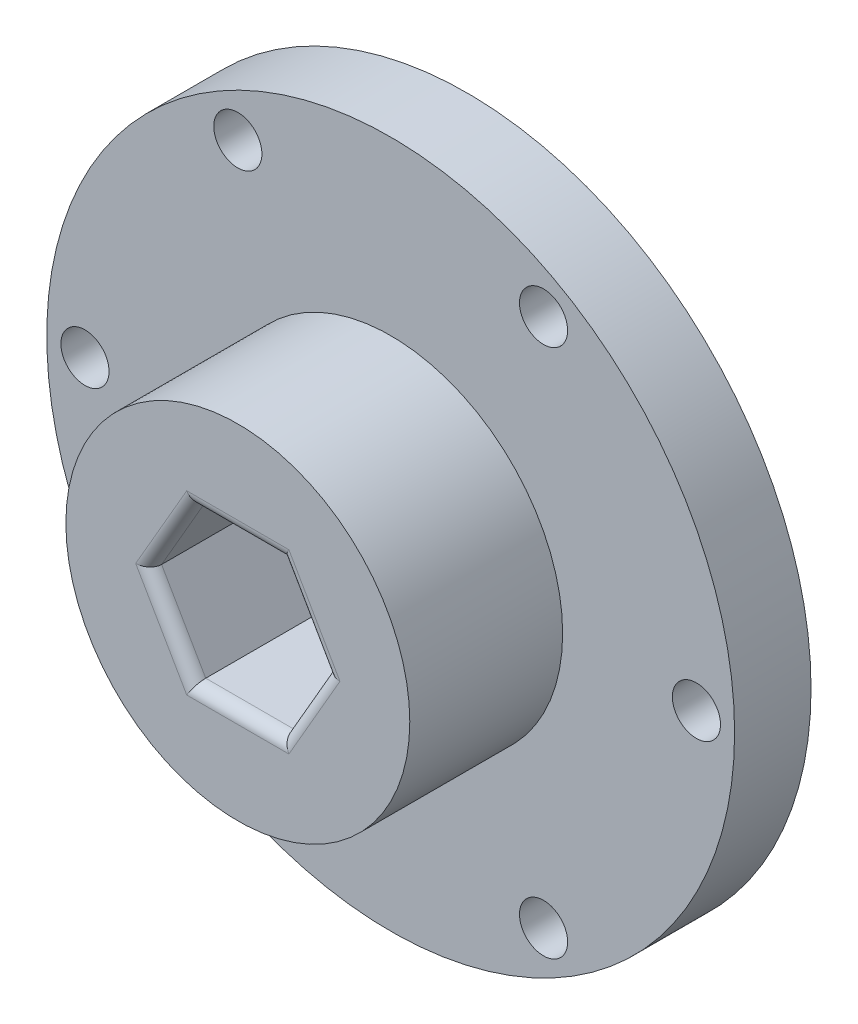
ISO-10303-21;
HEADER;
FILE_DESCRIPTION(('STEP AP214'),'2;1');
FILE_NAME('part.step','',(''),(''),'','','');
FILE_SCHEMA(('AUTOMOTIVE_DESIGN { 1 0 10303 214 1 1 1 1 }'));
ENDSEC;
DATA;
#1=APPLICATION_CONTEXT('core data for automotive mechanical design processes');
#2=APPLICATION_PROTOCOL_DEFINITION('international standard','automotive_design',2000,#1);
#3=PRODUCT_CONTEXT('',#1,'mechanical');
#4=PRODUCT('Part','Part','',(#3));
#5=PRODUCT_RELATED_PRODUCT_CATEGORY('part','',(#4));
#6=PRODUCT_DEFINITION_FORMATION('','',#4);
#7=PRODUCT_DEFINITION_CONTEXT('part definition',#1,'design');
#8=PRODUCT_DEFINITION('design','',#6,#7);
#9=PRODUCT_DEFINITION_SHAPE('','',#8);
#10=(LENGTH_UNIT() NAMED_UNIT(*) SI_UNIT(.MILLI.,.METRE.));
#11=(NAMED_UNIT(*) PLANE_ANGLE_UNIT() SI_UNIT($,.RADIAN.));
#12=(NAMED_UNIT(*) SI_UNIT($,.STERADIAN.) SOLID_ANGLE_UNIT());
#13=UNCERTAINTY_MEASURE_WITH_UNIT(LENGTH_MEASURE(1.E-05),#10,'distance_accuracy_value','');
#14=(GEOMETRIC_REPRESENTATION_CONTEXT(3) GLOBAL_UNCERTAINTY_ASSIGNED_CONTEXT((#13)) GLOBAL_UNIT_ASSIGNED_CONTEXT((#10,
#11,#12)) REPRESENTATION_CONTEXT('',''));
#15=CARTESIAN_POINT('',(0.,0.,0.));
#16=DIRECTION('',(0.,0.,1.));
#17=DIRECTION('',(1.,0.,0.));
#18=AXIS2_PLACEMENT_3D('',#15,#16,#17);
#19=CARTESIAN_POINT('',(0.,0.,6.35));
#20=DIRECTION('',(0.,0.,-1.));
#21=DIRECTION('',(-1.,0.,0.));
#22=AXIS2_PLACEMENT_3D('',#19,#20,#21);
#23=CYLINDRICAL_SURFACE('',#22,28.575);
#24=CARTESIAN_POINT('',(0.,0.,6.35));
#25=DIRECTION('',(0.,0.,1.));
#26=DIRECTION('',(1.,0.,0.));
#27=AXIS2_PLACEMENT_3D('',#24,#25,#26);
#28=CIRCLE('',#27,28.575);
#29=CARTESIAN_POINT('',(28.575,0.,6.35));
#30=VERTEX_POINT('',#29);
#31=EDGE_CURVE('E168',#30,#30,#28,.T.);
#32=ORIENTED_EDGE('',*,*,#31,.F.);
#33=EDGE_LOOP('',(#32));
#34=FACE_BOUND('',#33,.T.);
#35=CARTESIAN_POINT('',(0.,0.,0.));
#36=DIRECTION('',(0.,0.,1.));
#37=DIRECTION('',(1.,0.,0.));
#38=AXIS2_PLACEMENT_3D('',#35,#36,#37);
#39=CIRCLE('',#38,28.575);
#40=CARTESIAN_POINT('',(28.575,0.,0.));
#41=VERTEX_POINT('',#40);
#42=EDGE_CURVE('E163',#41,#41,#39,.T.);
#43=ORIENTED_EDGE('',*,*,#42,.T.);
#44=EDGE_LOOP('',(#43));
#45=FACE_BOUND('',#44,.T.);
#46=ADVANCED_FACE('F39',(#34,#45),#23,.T.);
#47=CARTESIAN_POINT('',(0.,0.,6.35));
#48=DIRECTION('',(0.,0.,1.));
#49=DIRECTION('',(1.,0.,0.));
#50=AXIS2_PLACEMENT_3D('',#47,#48,#49);
#51=PLANE('',#50);
#52=CARTESIAN_POINT('',(25.4,0.,6.35));
#53=DIRECTION('',(0.,0.,1.));
#54=DIRECTION('',(1.,0.,0.));
#55=AXIS2_PLACEMENT_3D('',#52,#53,#54);
#56=CIRCLE('',#55,2.);
#57=CARTESIAN_POINT('',(27.4,0.,6.35));
#58=VERTEX_POINT('',#57);
#59=EDGE_CURVE('E136',#58,#58,#56,.T.);
#60=ORIENTED_EDGE('',*,*,#59,.F.);
#61=EDGE_LOOP('',(#60));
#62=FACE_BOUND('',#61,.T.);
#63=CARTESIAN_POINT('',(12.7000000000003,21.9970452561246,6.35));
#64=DIRECTION('',(0.,0.,1.));
#65=DIRECTION('',(1.,0.,0.));
#66=AXIS2_PLACEMENT_3D('',#63,#64,#65);
#67=CIRCLE('',#66,2.);
#68=CARTESIAN_POINT('',(14.7000000000003,21.9970452561246,6.35));
#69=VERTEX_POINT('',#68);
#70=EDGE_CURVE('E215',#69,#69,#67,.T.);
#71=ORIENTED_EDGE('',*,*,#70,.F.);
#72=EDGE_LOOP('',(#71));
#73=FACE_BOUND('',#72,.T.);
#74=CARTESIAN_POINT('',(-12.6999999999998,21.9970452561249,6.35));
#75=DIRECTION('',(0.,0.,1.));
#76=DIRECTION('',(1.,0.,0.));
#77=AXIS2_PLACEMENT_3D('',#74,#75,#76);
#78=CIRCLE('',#77,2.);
#79=CARTESIAN_POINT('',(-10.6999999999998,21.9970452561249,6.35));
#80=VERTEX_POINT('',#79);
#81=EDGE_CURVE('E240',#80,#80,#78,.T.);
#82=ORIENTED_EDGE('',*,*,#81,.F.);
#83=EDGE_LOOP('',(#82));
#84=FACE_BOUND('',#83,.T.);
#85=CARTESIAN_POINT('',(-25.4,1.77367252013231E-13,6.35));
#86=DIRECTION('',(0.,0.,1.));
#87=DIRECTION('',(1.,0.,0.));
#88=AXIS2_PLACEMENT_3D('',#85,#86,#87);
#89=CIRCLE('',#88,2.);
#90=CARTESIAN_POINT('',(-23.4,1.77367252013231E-13,6.35));
#91=VERTEX_POINT('',#90);
#92=EDGE_CURVE('E235',#91,#91,#89,.T.);
#93=ORIENTED_EDGE('',*,*,#92,.F.);
#94=EDGE_LOOP('',(#93));
#95=FACE_BOUND('',#94,.T.);
#96=CARTESIAN_POINT('',(-12.7000000000001,-21.9970452561247,6.35));
#97=DIRECTION('',(0.,0.,1.));
#98=DIRECTION('',(1.,0.,0.));
#99=AXIS2_PLACEMENT_3D('',#96,#97,#98);
#100=CIRCLE('',#99,2.00000000000001);
#101=CARTESIAN_POINT('',(-10.7000000000001,-21.9970452561247,6.35));
#102=VERTEX_POINT('',#101);
#103=EDGE_CURVE('E229',#102,#102,#100,.T.);
#104=ORIENTED_EDGE('',*,*,#103,.F.);
#105=EDGE_LOOP('',(#104));
#106=FACE_BOUND('',#105,.T.);
#107=CARTESIAN_POINT('',(12.6999999999999,-21.9970452561248,6.35));
#108=DIRECTION('',(0.,0.,1.));
#109=DIRECTION('',(1.,0.,0.));
#110=AXIS2_PLACEMENT_3D('',#107,#108,#109);
#111=CIRCLE('',#110,2.);
#112=CARTESIAN_POINT('',(14.7,-21.9970452561248,6.35));
#113=VERTEX_POINT('',#112);
#114=EDGE_CURVE('E223',#113,#113,#111,.T.);
#115=ORIENTED_EDGE('',*,*,#114,.F.);
#116=EDGE_LOOP('',(#115));
#117=FACE_BOUND('',#116,.T.);
#118=CARTESIAN_POINT('',(0.,0.,6.35));
#119=DIRECTION('',(0.,0.,1.));
#120=DIRECTION('',(1.,0.,0.));
#121=AXIS2_PLACEMENT_3D('',#118,#119,#120);
#122=CIRCLE('',#121,14.2875);
#123=CARTESIAN_POINT('',(14.2875,0.,6.35));
#124=VERTEX_POINT('',#123);
#125=EDGE_CURVE('E164',#124,#124,#122,.T.);
#126=ORIENTED_EDGE('',*,*,#125,.F.);
#127=EDGE_LOOP('',(#126));
#128=FACE_BOUND('',#127,.T.);
#129=ORIENTED_EDGE('',*,*,#31,.T.);
#130=EDGE_LOOP('',(#129));
#131=FACE_BOUND('',#130,.T.);
#132=ADVANCED_FACE('F266',(#62,#73,#84,#95,#106,#117,#128,#131),#51,.T.);
#133=CARTESIAN_POINT('',(0.,0.,0.));
#134=DIRECTION('',(0.,0.,1.));
#135=DIRECTION('',(1.,0.,0.));
#136=AXIS2_PLACEMENT_3D('',#133,#134,#135);
#137=PLANE('',#136);
#138=CARTESIAN_POINT('',(25.4,0.,0.));
#139=DIRECTION('',(0.,0.,1.));
#140=DIRECTION('',(1.,0.,0.));
#141=AXIS2_PLACEMENT_3D('',#138,#139,#140);
#142=CIRCLE('',#141,2.);
#143=CARTESIAN_POINT('',(27.4,0.,0.));
#144=VERTEX_POINT('',#143);
#145=EDGE_CURVE('E133',#144,#144,#142,.T.);
#146=ORIENTED_EDGE('',*,*,#145,.T.);
#147=EDGE_LOOP('',(#146));
#148=FACE_BOUND('',#147,.T.);
#149=CARTESIAN_POINT('',(12.7000000000003,21.9970452561246,0.));
#150=DIRECTION('',(0.,0.,1.));
#151=DIRECTION('',(1.,0.,0.));
#152=AXIS2_PLACEMENT_3D('',#149,#150,#151);
#153=CIRCLE('',#152,2.);
#154=CARTESIAN_POINT('',(14.7000000000003,21.9970452561246,0.));
#155=VERTEX_POINT('',#154);
#156=EDGE_CURVE('E210',#155,#155,#153,.T.);
#157=ORIENTED_EDGE('',*,*,#156,.T.);
#158=EDGE_LOOP('',(#157));
#159=FACE_BOUND('',#158,.T.);
#160=CARTESIAN_POINT('',(-12.6999999999998,21.9970452561249,0.));
#161=DIRECTION('',(0.,0.,1.));
#162=DIRECTION('',(1.,0.,0.));
#163=AXIS2_PLACEMENT_3D('',#160,#161,#162);
#164=CIRCLE('',#163,2.);
#165=CARTESIAN_POINT('',(-10.6999999999998,21.9970452561249,0.));
#166=VERTEX_POINT('',#165);
#167=EDGE_CURVE('E139',#166,#166,#164,.T.);
#168=ORIENTED_EDGE('',*,*,#167,.T.);
#169=EDGE_LOOP('',(#168));
#170=FACE_BOUND('',#169,.T.);
#171=CARTESIAN_POINT('',(-25.4,1.77367252013231E-13,0.));
#172=DIRECTION('',(0.,0.,1.));
#173=DIRECTION('',(1.,0.,0.));
#174=AXIS2_PLACEMENT_3D('',#171,#172,#173);
#175=CIRCLE('',#174,2.);
#176=CARTESIAN_POINT('',(-23.4,1.77367252013231E-13,0.));
#177=VERTEX_POINT('',#176);
#178=EDGE_CURVE('E238',#177,#177,#175,.T.);
#179=ORIENTED_EDGE('',*,*,#178,.T.);
#180=EDGE_LOOP('',(#179));
#181=FACE_BOUND('',#180,.T.);
#182=CARTESIAN_POINT('',(-12.7000000000001,-21.9970452561247,0.));
#183=DIRECTION('',(0.,0.,1.));
#184=DIRECTION('',(1.,0.,0.));
#185=AXIS2_PLACEMENT_3D('',#182,#183,#184);
#186=CIRCLE('',#185,2.00000000000001);
#187=CARTESIAN_POINT('',(-10.7000000000001,-21.9970452561247,0.));
#188=VERTEX_POINT('',#187);
#189=EDGE_CURVE('E232',#188,#188,#186,.T.);
#190=ORIENTED_EDGE('',*,*,#189,.T.);
#191=EDGE_LOOP('',(#190));
#192=FACE_BOUND('',#191,.T.);
#193=CARTESIAN_POINT('',(12.6999999999999,-21.9970452561248,0.));
#194=DIRECTION('',(0.,0.,1.));
#195=DIRECTION('',(1.,0.,0.));
#196=AXIS2_PLACEMENT_3D('',#193,#194,#195);
#197=CIRCLE('',#196,2.);
#198=CARTESIAN_POINT('',(14.7,-21.9970452561248,0.));
#199=VERTEX_POINT('',#198);
#200=EDGE_CURVE('E226',#199,#199,#197,.T.);
#201=ORIENTED_EDGE('',*,*,#200,.T.);
#202=EDGE_LOOP('',(#201));
#203=FACE_BOUND('',#202,.T.);
#204=DIRECTION('',(1.,0.,0.));
#205=VECTOR('',#204,1.);
#206=CARTESIAN_POINT('',(-3.66617420935413,-6.35,0.));
#207=LINE('',#206,#205);
#208=CARTESIAN_POINT('',(-3.66617420935413,-6.35,0.));
#209=VERTEX_POINT('',#208);
#210=CARTESIAN_POINT('',(3.66617420935412,-6.35,0.));
#211=VERTEX_POINT('',#210);
#212=EDGE_CURVE('E118',#209,#211,#207,.T.);
#213=ORIENTED_EDGE('',*,*,#212,.T.);
#214=DIRECTION('',(0.5,0.866025403784439,0.));
#215=VECTOR('',#214,1.);
#216=CARTESIAN_POINT('',(3.66617420935412,-6.35,0.));
#217=LINE('',#216,#215);
#218=CARTESIAN_POINT('',(7.33234841870824,0.,0.));
#219=VERTEX_POINT('',#218);
#220=EDGE_CURVE('E113',#211,#219,#217,.T.);
#221=ORIENTED_EDGE('',*,*,#220,.T.);
#222=DIRECTION('',(-0.5,0.866025403784439,0.));
#223=VECTOR('',#222,1.);
#224=CARTESIAN_POINT('',(7.33234841870824,0.,0.));
#225=LINE('',#224,#223);
#226=CARTESIAN_POINT('',(3.66617420935412,6.35,0.));
#227=VERTEX_POINT('',#226);
#228=EDGE_CURVE('E122',#219,#227,#225,.T.);
#229=ORIENTED_EDGE('',*,*,#228,.T.);
#230=DIRECTION('',(-1.,0.,0.));
#231=VECTOR('',#230,1.);
#232=CARTESIAN_POINT('',(3.66617420935412,6.35,0.));
#233=LINE('',#232,#231);
#234=CARTESIAN_POINT('',(-3.66617420935412,6.35,0.));
#235=VERTEX_POINT('',#234);
#236=EDGE_CURVE('E127',#227,#235,#233,.T.);
#237=ORIENTED_EDGE('',*,*,#236,.T.);
#238=DIRECTION('',(-0.5,-0.866025403784439,0.));
#239=VECTOR('',#238,1.);
#240=CARTESIAN_POINT('',(-3.66617420935412,6.35,0.));
#241=LINE('',#240,#239);
#242=CARTESIAN_POINT('',(-7.33234841870825,0.,0.));
#243=VERTEX_POINT('',#242);
#244=EDGE_CURVE('E143',#235,#243,#241,.T.);
#245=ORIENTED_EDGE('',*,*,#244,.T.);
#246=DIRECTION('',(0.5,-0.866025403784439,0.));
#247=VECTOR('',#246,1.);
#248=CARTESIAN_POINT('',(-7.33234841870825,0.,0.));
#249=LINE('',#248,#247);
#250=EDGE_CURVE('E146',#243,#209,#249,.T.);
#251=ORIENTED_EDGE('',*,*,#250,.T.);
#252=EDGE_LOOP('',(#213,#221,#229,#237,#245,#251));
#253=FACE_BOUND('',#252,.T.);
#254=ORIENTED_EDGE('',*,*,#42,.F.);
#255=EDGE_LOOP('',(#254));
#256=FACE_BOUND('',#255,.T.);
#257=ADVANCED_FACE('F129',(#148,#159,#170,#181,#192,#203,#253,#256),#137,.F.);
#258=CARTESIAN_POINT('',(0.,0.,19.05));
#259=DIRECTION('',(0.,0.,-1.));
#260=DIRECTION('',(-1.,0.,0.));
#261=AXIS2_PLACEMENT_3D('',#258,#259,#260);
#262=CYLINDRICAL_SURFACE('',#261,14.2875);
#263=CARTESIAN_POINT('',(0.,0.,19.05));
#264=DIRECTION('',(0.,0.,1.));
#265=DIRECTION('',(1.,0.,0.));
#266=AXIS2_PLACEMENT_3D('',#263,#264,#265);
#267=CIRCLE('',#266,14.2875);
#268=CARTESIAN_POINT('',(14.2875,0.,19.05));
#269=VERTEX_POINT('',#268);
#270=EDGE_CURVE('E151',#269,#269,#267,.T.);
#271=ORIENTED_EDGE('',*,*,#270,.F.);
#272=EDGE_LOOP('',(#271));
#273=FACE_BOUND('',#272,.T.);
#274=ORIENTED_EDGE('',*,*,#125,.T.);
#275=EDGE_LOOP('',(#274));
#276=FACE_BOUND('',#275,.T.);
#277=ADVANCED_FACE('F342',(#273,#276),#262,.T.);
#278=CARTESIAN_POINT('',(0.,0.,19.05));
#279=DIRECTION('',(0.,0.,1.));
#280=DIRECTION('',(1.,0.,0.));
#281=AXIS2_PLACEMENT_3D('',#278,#279,#280);
#282=PLANE('',#281);
#283=DIRECTION('',(-0.5,-0.866025403784439,0.));
#284=VECTOR('',#283,1.);
#285=CARTESIAN_POINT('',(-4.53219961313856,6.85,19.05));
#286=LINE('',#285,#284);
#287=CARTESIAN_POINT('',(-8.4870489570875,0.,19.05));
#288=VERTEX_POINT('',#287);
#289=CARTESIAN_POINT('',(-4.24352447854375,7.35,19.05));
#290=VERTEX_POINT('',#289);
#291=EDGE_CURVE('E183',#288,#290,#286,.F.);
#292=ORIENTED_EDGE('',*,*,#291,.T.);
#293=DIRECTION('',(-1.,0.,0.));
#294=VECTOR('',#293,1.);
#295=CARTESIAN_POINT('',(3.66617420935412,7.35,19.05));
#296=LINE('',#295,#294);
#297=CARTESIAN_POINT('',(4.24352447854375,7.35,19.05));
#298=VERTEX_POINT('',#297);
#299=EDGE_CURVE('E185',#290,#298,#296,.F.);
#300=ORIENTED_EDGE('',*,*,#299,.T.);
#301=DIRECTION('',(-0.5,0.866025403784439,0.));
#302=VECTOR('',#301,1.);
#303=CARTESIAN_POINT('',(8.19837382249268,0.5,19.05));
#304=LINE('',#303,#302);
#305=CARTESIAN_POINT('',(8.4870489570875,0.,19.05));
#306=VERTEX_POINT('',#305);
#307=EDGE_CURVE('E175',#298,#306,#304,.F.);
#308=ORIENTED_EDGE('',*,*,#307,.T.);
#309=DIRECTION('',(0.5,0.866025403784439,0.));
#310=VECTOR('',#309,1.);
#311=CARTESIAN_POINT('',(4.53219961313856,-6.85,19.05));
#312=LINE('',#311,#310);
#313=CARTESIAN_POINT('',(4.24352447854375,-7.35,19.05));
#314=VERTEX_POINT('',#313);
#315=EDGE_CURVE('E177',#306,#314,#312,.F.);
#316=ORIENTED_EDGE('',*,*,#315,.T.);
#317=DIRECTION('',(1.,0.,0.));
#318=VECTOR('',#317,1.);
#319=CARTESIAN_POINT('',(-3.66617420935413,-7.35,19.05));
#320=LINE('',#319,#318);
#321=CARTESIAN_POINT('',(-4.24352447854375,-7.35,19.05));
#322=VERTEX_POINT('',#321);
#323=EDGE_CURVE('E179',#314,#322,#320,.F.);
#324=ORIENTED_EDGE('',*,*,#323,.T.);
#325=DIRECTION('',(0.5,-0.866025403784439,0.));
#326=VECTOR('',#325,1.);
#327=CARTESIAN_POINT('',(-8.19837382249269,-0.499999999999999,19.05));
#328=LINE('',#327,#326);
#329=EDGE_CURVE('E181',#322,#288,#328,.F.);
#330=ORIENTED_EDGE('',*,*,#329,.T.);
#331=EDGE_LOOP('',(#292,#300,#308,#316,#324,#330));
#332=FACE_BOUND('',#331,.T.);
#333=ORIENTED_EDGE('',*,*,#270,.T.);
#334=EDGE_LOOP('',(#333));
#335=FACE_BOUND('',#334,.T.);
#336=ADVANCED_FACE('F309',(#332,#335),#282,.T.);
#337=CARTESIAN_POINT('',(3.66617420935412,-6.35,0.));
#338=DIRECTION('',(0.866025403784439,-0.5,0.));
#339=DIRECTION('',(0.5,0.866025403784439,0.));
#340=AXIS2_PLACEMENT_3D('',#337,#338,#339);
#341=PLANE('',#340);
#342=DIRECTION('',(0.,0.,1.));
#343=VECTOR('',#342,1.);
#344=CARTESIAN_POINT('',(3.66617420935412,-6.35,0.));
#345=LINE('',#344,#343);
#346=CARTESIAN_POINT('',(3.66617420935412,-6.35,18.05));
#347=VERTEX_POINT('',#346);
#348=EDGE_CURVE('E149',#211,#347,#345,.T.);
#349=ORIENTED_EDGE('',*,*,#348,.T.);
#350=DIRECTION('',(0.5,0.866025403784439,0.));
#351=VECTOR('',#350,1.);
#352=CARTESIAN_POINT('',(7.33234841870824,0.,18.05));
#353=LINE('',#352,#351);
#354=CARTESIAN_POINT('',(7.33234841870824,0.,18.05));
#355=VERTEX_POINT('',#354);
#356=EDGE_CURVE('E48',#347,#355,#353,.T.);
#357=ORIENTED_EDGE('',*,*,#356,.T.);
#358=DIRECTION('',(0.,0.,1.));
#359=VECTOR('',#358,1.);
#360=CARTESIAN_POINT('',(7.33234841870824,0.,0.));
#361=LINE('',#360,#359);
#362=EDGE_CURVE('E109',#219,#355,#361,.T.);
#363=ORIENTED_EDGE('',*,*,#362,.F.);
#364=ORIENTED_EDGE('',*,*,#220,.F.);
#365=EDGE_LOOP('',(#349,#357,#363,#364));
#366=FACE_BOUND('',#365,.T.);
#367=ADVANCED_FACE('F111',(#366),#341,.F.);
#368=CARTESIAN_POINT('',(-3.66617420935413,-6.35,0.));
#369=DIRECTION('',(0.,-1.,0.));
#370=DIRECTION('',(1.,0.,0.));
#371=AXIS2_PLACEMENT_3D('',#368,#369,#370);
#372=PLANE('',#371);
#373=DIRECTION('',(0.,0.,1.));
#374=VECTOR('',#373,1.);
#375=CARTESIAN_POINT('',(-3.66617420935413,-6.35,0.));
#376=LINE('',#375,#374);
#377=CARTESIAN_POINT('',(-3.66617420935413,-6.35,18.05));
#378=VERTEX_POINT('',#377);
#379=EDGE_CURVE('E152',#209,#378,#376,.T.);
#380=ORIENTED_EDGE('',*,*,#379,.T.);
#381=DIRECTION('',(1.,0.,0.));
#382=VECTOR('',#381,1.);
#383=CARTESIAN_POINT('',(3.66617420935412,-6.35,18.05));
#384=LINE('',#383,#382);
#385=EDGE_CURVE('E63',#378,#347,#384,.T.);
#386=ORIENTED_EDGE('',*,*,#385,.T.);
#387=ORIENTED_EDGE('',*,*,#348,.F.);
#388=ORIENTED_EDGE('',*,*,#212,.F.);
#389=EDGE_LOOP('',(#380,#386,#387,#388));
#390=FACE_BOUND('',#389,.T.);
#391=ADVANCED_FACE('F325',(#390),#372,.F.);
#392=CARTESIAN_POINT('',(-7.33234841870825,0.,0.));
#393=DIRECTION('',(-0.866025403784439,-0.5,0.));
#394=DIRECTION('',(0.5,-0.866025403784439,0.));
#395=AXIS2_PLACEMENT_3D('',#392,#393,#394);
#396=PLANE('',#395);
#397=DIRECTION('',(0.,0.,1.));
#398=VECTOR('',#397,1.);
#399=CARTESIAN_POINT('',(-7.33234841870825,0.,0.));
#400=LINE('',#399,#398);
#401=CARTESIAN_POINT('',(-7.33234841870825,0.,18.05));
#402=VERTEX_POINT('',#401);
#403=EDGE_CURVE('E154',#243,#402,#400,.T.);
#404=ORIENTED_EDGE('',*,*,#403,.T.);
#405=DIRECTION('',(0.5,-0.866025403784439,0.));
#406=VECTOR('',#405,1.);
#407=CARTESIAN_POINT('',(-3.66617420935413,-6.35,18.05));
#408=LINE('',#407,#406);
#409=EDGE_CURVE('E190',#402,#378,#408,.T.);
#410=ORIENTED_EDGE('',*,*,#409,.T.);
#411=ORIENTED_EDGE('',*,*,#379,.F.);
#412=ORIENTED_EDGE('',*,*,#250,.F.);
#413=EDGE_LOOP('',(#404,#410,#411,#412));
#414=FACE_BOUND('',#413,.T.);
#415=ADVANCED_FACE('F324',(#414),#396,.F.);
#416=CARTESIAN_POINT('',(-3.66617420935412,6.35,0.));
#417=DIRECTION('',(-0.866025403784439,0.5,0.));
#418=DIRECTION('',(-0.5,-0.866025403784439,0.));
#419=AXIS2_PLACEMENT_3D('',#416,#417,#418);
#420=PLANE('',#419);
#421=DIRECTION('',(0.,0.,1.));
#422=VECTOR('',#421,1.);
#423=CARTESIAN_POINT('',(-3.66617420935412,6.35,0.));
#424=LINE('',#423,#422);
#425=CARTESIAN_POINT('',(-3.66617420935412,6.35,18.05));
#426=VERTEX_POINT('',#425);
#427=EDGE_CURVE('E157',#235,#426,#424,.T.);
#428=ORIENTED_EDGE('',*,*,#427,.T.);
#429=DIRECTION('',(-0.5,-0.866025403784439,0.));
#430=VECTOR('',#429,1.);
#431=CARTESIAN_POINT('',(-7.33234841870825,0.,18.05));
#432=LINE('',#431,#430);
#433=EDGE_CURVE('E188',#426,#402,#432,.T.);
#434=ORIENTED_EDGE('',*,*,#433,.T.);
#435=ORIENTED_EDGE('',*,*,#403,.F.);
#436=ORIENTED_EDGE('',*,*,#244,.F.);
#437=EDGE_LOOP('',(#428,#434,#435,#436));
#438=FACE_BOUND('',#437,.T.);
#439=ADVANCED_FACE('F321',(#438),#420,.F.);
#440=CARTESIAN_POINT('',(3.66617420935412,6.35,0.));
#441=DIRECTION('',(0.,1.,0.));
#442=DIRECTION('',(-1.,0.,0.));
#443=AXIS2_PLACEMENT_3D('',#440,#441,#442);
#444=PLANE('',#443);
#445=DIRECTION('',(0.,0.,1.));
#446=VECTOR('',#445,1.);
#447=CARTESIAN_POINT('',(3.66617420935412,6.35,0.));
#448=LINE('',#447,#446);
#449=CARTESIAN_POINT('',(3.66617420935412,6.35,18.05));
#450=VERTEX_POINT('',#449);
#451=EDGE_CURVE('E117',#227,#450,#448,.T.);
#452=ORIENTED_EDGE('',*,*,#451,.T.);
#453=DIRECTION('',(-1.,0.,0.));
#454=VECTOR('',#453,1.);
#455=CARTESIAN_POINT('',(-3.66617420935412,6.35,18.05));
#456=LINE('',#455,#454);
#457=EDGE_CURVE('E167',#450,#426,#456,.T.);
#458=ORIENTED_EDGE('',*,*,#457,.T.);
#459=ORIENTED_EDGE('',*,*,#427,.F.);
#460=ORIENTED_EDGE('',*,*,#236,.F.);
#461=EDGE_LOOP('',(#452,#458,#459,#460));
#462=FACE_BOUND('',#461,.T.);
#463=ADVANCED_FACE('F317',(#462),#444,.F.);
#464=CARTESIAN_POINT('',(7.33234841870824,0.,0.));
#465=DIRECTION('',(0.866025403784439,0.5,0.));
#466=DIRECTION('',(-0.5,0.866025403784439,0.));
#467=AXIS2_PLACEMENT_3D('',#464,#465,#466);
#468=PLANE('',#467);
#469=ORIENTED_EDGE('',*,*,#362,.T.);
#470=DIRECTION('',(-0.5,0.866025403784439,0.));
#471=VECTOR('',#470,1.);
#472=CARTESIAN_POINT('',(3.66617420935412,6.35,18.05));
#473=LINE('',#472,#471);
#474=EDGE_CURVE('E11',#355,#450,#473,.T.);
#475=ORIENTED_EDGE('',*,*,#474,.T.);
#476=ORIENTED_EDGE('',*,*,#451,.F.);
#477=ORIENTED_EDGE('',*,*,#228,.F.);
#478=EDGE_LOOP('',(#469,#475,#476,#477));
#479=FACE_BOUND('',#478,.T.);
#480=ADVANCED_FACE('F123',(#479),#468,.F.);
#481=CARTESIAN_POINT('',(12.6999999999999,-21.9970452561248,0.));
#482=DIRECTION('',(0.,0.,1.));
#483=DIRECTION('',(1.,0.,0.));
#484=AXIS2_PLACEMENT_3D('',#481,#482,#483);
#485=CYLINDRICAL_SURFACE('',#484,2.);
#486=ORIENTED_EDGE('',*,*,#200,.F.);
#487=EDGE_LOOP('',(#486));
#488=FACE_BOUND('',#487,.T.);
#489=ORIENTED_EDGE('',*,*,#114,.T.);
#490=EDGE_LOOP('',(#489));
#491=FACE_BOUND('',#490,.T.);
#492=ADVANCED_FACE('F338',(#488,#491),#485,.F.);
#493=CARTESIAN_POINT('',(-12.7000000000001,-21.9970452561247,0.));
#494=DIRECTION('',(0.,0.,1.));
#495=DIRECTION('',(1.,0.,0.));
#496=AXIS2_PLACEMENT_3D('',#493,#494,#495);
#497=CYLINDRICAL_SURFACE('',#496,2.00000000000001);
#498=ORIENTED_EDGE('',*,*,#189,.F.);
#499=EDGE_LOOP('',(#498));
#500=FACE_BOUND('',#499,.T.);
#501=ORIENTED_EDGE('',*,*,#103,.T.);
#502=EDGE_LOOP('',(#501));
#503=FACE_BOUND('',#502,.T.);
#504=ADVANCED_FACE('F261',(#500,#503),#497,.F.);
#505=CARTESIAN_POINT('',(-25.4,1.77367252013231E-13,0.));
#506=DIRECTION('',(0.,0.,1.));
#507=DIRECTION('',(1.,0.,0.));
#508=AXIS2_PLACEMENT_3D('',#505,#506,#507);
#509=CYLINDRICAL_SURFACE('',#508,2.);
#510=ORIENTED_EDGE('',*,*,#178,.F.);
#511=EDGE_LOOP('',(#510));
#512=FACE_BOUND('',#511,.T.);
#513=ORIENTED_EDGE('',*,*,#92,.T.);
#514=EDGE_LOOP('',(#513));
#515=FACE_BOUND('',#514,.T.);
#516=ADVANCED_FACE('F252',(#512,#515),#509,.F.);
#517=CARTESIAN_POINT('',(-12.6999999999998,21.9970452561249,0.));
#518=DIRECTION('',(0.,0.,1.));
#519=DIRECTION('',(1.,0.,0.));
#520=AXIS2_PLACEMENT_3D('',#517,#518,#519);
#521=CYLINDRICAL_SURFACE('',#520,2.);
#522=ORIENTED_EDGE('',*,*,#167,.F.);
#523=EDGE_LOOP('',(#522));
#524=FACE_BOUND('',#523,.T.);
#525=ORIENTED_EDGE('',*,*,#81,.T.);
#526=EDGE_LOOP('',(#525));
#527=FACE_BOUND('',#526,.T.);
#528=ADVANCED_FACE('F249',(#524,#527),#521,.F.);
#529=CARTESIAN_POINT('',(12.7000000000003,21.9970452561246,0.));
#530=DIRECTION('',(0.,0.,1.));
#531=DIRECTION('',(1.,0.,0.));
#532=AXIS2_PLACEMENT_3D('',#529,#530,#531);
#533=CYLINDRICAL_SURFACE('',#532,2.);
#534=ORIENTED_EDGE('',*,*,#156,.F.);
#535=EDGE_LOOP('',(#534));
#536=FACE_BOUND('',#535,.T.);
#537=ORIENTED_EDGE('',*,*,#70,.T.);
#538=EDGE_LOOP('',(#537));
#539=FACE_BOUND('',#538,.T.);
#540=ADVANCED_FACE('F251',(#536,#539),#533,.F.);
#541=CARTESIAN_POINT('',(25.4,0.,0.));
#542=DIRECTION('',(0.,0.,1.));
#543=DIRECTION('',(1.,0.,0.));
#544=AXIS2_PLACEMENT_3D('',#541,#542,#543);
#545=CYLINDRICAL_SURFACE('',#544,2.);
#546=ORIENTED_EDGE('',*,*,#145,.F.);
#547=EDGE_LOOP('',(#546));
#548=FACE_BOUND('',#547,.T.);
#549=ORIENTED_EDGE('',*,*,#59,.T.);
#550=EDGE_LOOP('',(#549));
#551=FACE_BOUND('',#550,.T.);
#552=ADVANCED_FACE('F258',(#548,#551),#545,.F.);
#553=CARTESIAN_POINT('',(-3.66617420935413,-7.35,18.05));
#554=DIRECTION('',(-1.,0.,0.));
#555=DIRECTION('',(0.,-1.,0.));
#556=AXIS2_PLACEMENT_3D('',#553,#554,#555);
#557=CYLINDRICAL_SURFACE('',#556,1.);
#558=CARTESIAN_POINT('',(-4.24352447854375,-7.35,18.05));
#559=DIRECTION('',(-0.866025403784439,0.5,0.));
#560=DIRECTION('',(0.5,0.866025403784439,0.));
#561=AXIS2_PLACEMENT_3D('',#558,#559,#560);
#562=ELLIPSE('',#561,1.15470053837925,1.);
#563=EDGE_CURVE('E203',#322,#378,#562,.T.);
#564=ORIENTED_EDGE('',*,*,#563,.F.);
#565=ORIENTED_EDGE('',*,*,#323,.F.);
#566=CARTESIAN_POINT('',(4.24352447854375,-7.35,18.05));
#567=DIRECTION('',(-0.866025403784439,-0.5,0.));
#568=DIRECTION('',(-0.5,0.866025403784439,0.));
#569=AXIS2_PLACEMENT_3D('',#566,#567,#568);
#570=ELLIPSE('',#569,1.15470053837925,1.);
#571=EDGE_CURVE('E43',#347,#314,#570,.F.);
#572=ORIENTED_EDGE('',*,*,#571,.F.);
#573=ORIENTED_EDGE('',*,*,#385,.F.);
#574=EDGE_LOOP('',(#564,#565,#572,#573));
#575=FACE_BOUND('',#574,.T.);
#576=ADVANCED_FACE('F41',(#575),#557,.T.);
#577=CARTESIAN_POINT('',(4.53219961313856,-6.85,18.05));
#578=DIRECTION('',(-0.5,-0.866025403784439,0.));
#579=DIRECTION('',(0.866025403784439,-0.5,0.));
#580=AXIS2_PLACEMENT_3D('',#577,#578,#579);
#581=CYLINDRICAL_SURFACE('',#580,1.);
#582=ORIENTED_EDGE('',*,*,#571,.T.);
#583=ORIENTED_EDGE('',*,*,#315,.F.);
#584=CARTESIAN_POINT('',(8.4870489570875,0.,18.05));
#585=DIRECTION('',(0.,-1.,0.));
#586=DIRECTION('',(-1.,0.,0.));
#587=AXIS2_PLACEMENT_3D('',#584,#585,#586);
#588=ELLIPSE('',#587,1.15470053837925,1.);
#589=EDGE_CURVE('E201',#355,#306,#588,.F.);
#590=ORIENTED_EDGE('',*,*,#589,.F.);
#591=ORIENTED_EDGE('',*,*,#356,.F.);
#592=EDGE_LOOP('',(#582,#583,#590,#591));
#593=FACE_BOUND('',#592,.T.);
#594=ADVANCED_FACE('F293',(#593),#581,.T.);
#595=CARTESIAN_POINT('',(-8.19837382249269,-0.499999999999999,18.05));
#596=DIRECTION('',(-0.5,0.866025403784439,0.));
#597=DIRECTION('',(-0.866025403784439,-0.5,0.));
#598=AXIS2_PLACEMENT_3D('',#595,#596,#597);
#599=CYLINDRICAL_SURFACE('',#598,1.);
#600=ORIENTED_EDGE('',*,*,#563,.T.);
#601=ORIENTED_EDGE('',*,*,#409,.F.);
#602=CARTESIAN_POINT('',(-8.4870489570875,0.,18.05));
#603=DIRECTION('',(0.,1.,0.));
#604=DIRECTION('',(1.,0.,0.));
#605=AXIS2_PLACEMENT_3D('',#602,#603,#604);
#606=ELLIPSE('',#605,1.15470053837925,1.);
#607=EDGE_CURVE('E198',#288,#402,#606,.T.);
#608=ORIENTED_EDGE('',*,*,#607,.F.);
#609=ORIENTED_EDGE('',*,*,#329,.F.);
#610=EDGE_LOOP('',(#600,#601,#608,#609));
#611=FACE_BOUND('',#610,.T.);
#612=ADVANCED_FACE('F290',(#611),#599,.T.);
#613=CARTESIAN_POINT('',(8.19837382249268,0.5,18.05));
#614=DIRECTION('',(0.5,-0.866025403784439,0.));
#615=DIRECTION('',(0.866025403784439,0.5,0.));
#616=AXIS2_PLACEMENT_3D('',#613,#614,#615);
#617=CYLINDRICAL_SURFACE('',#616,1.);
#618=ORIENTED_EDGE('',*,*,#589,.T.);
#619=ORIENTED_EDGE('',*,*,#307,.F.);
#620=CARTESIAN_POINT('',(4.24352447854375,7.35,18.05));
#621=DIRECTION('',(0.866025403784439,-0.5,0.));
#622=DIRECTION('',(0.5,0.866025403784439,0.));
#623=AXIS2_PLACEMENT_3D('',#620,#621,#622);
#624=ELLIPSE('',#623,1.15470053837925,1.);
#625=EDGE_CURVE('E196',#450,#298,#624,.F.);
#626=ORIENTED_EDGE('',*,*,#625,.F.);
#627=ORIENTED_EDGE('',*,*,#474,.F.);
#628=EDGE_LOOP('',(#618,#619,#626,#627));
#629=FACE_BOUND('',#628,.T.);
#630=ADVANCED_FACE('F286',(#629),#617,.T.);
#631=CARTESIAN_POINT('',(-4.53219961313856,6.85,18.05));
#632=DIRECTION('',(0.5,0.866025403784439,0.));
#633=DIRECTION('',(-0.866025403784439,0.5,0.));
#634=AXIS2_PLACEMENT_3D('',#631,#632,#633);
#635=CYLINDRICAL_SURFACE('',#634,1.);
#636=ORIENTED_EDGE('',*,*,#607,.T.);
#637=ORIENTED_EDGE('',*,*,#433,.F.);
#638=CARTESIAN_POINT('',(-4.24352447854375,7.35,18.05));
#639=DIRECTION('',(0.866025403784439,0.5,0.));
#640=DIRECTION('',(0.5,-0.866025403784439,0.));
#641=AXIS2_PLACEMENT_3D('',#638,#639,#640);
#642=ELLIPSE('',#641,1.15470053837925,1.);
#643=EDGE_CURVE('E194',#290,#426,#642,.T.);
#644=ORIENTED_EDGE('',*,*,#643,.F.);
#645=ORIENTED_EDGE('',*,*,#291,.F.);
#646=EDGE_LOOP('',(#636,#637,#644,#645));
#647=FACE_BOUND('',#646,.T.);
#648=ADVANCED_FACE('F282',(#647),#635,.T.);
#649=CARTESIAN_POINT('',(3.66617420935412,7.35,18.05));
#650=DIRECTION('',(1.,0.,0.));
#651=DIRECTION('',(0.,1.,0.));
#652=AXIS2_PLACEMENT_3D('',#649,#650,#651);
#653=CYLINDRICAL_SURFACE('',#652,1.);
#654=ORIENTED_EDGE('',*,*,#625,.T.);
#655=ORIENTED_EDGE('',*,*,#299,.F.);
#656=ORIENTED_EDGE('',*,*,#643,.T.);
#657=ORIENTED_EDGE('',*,*,#457,.F.);
#658=EDGE_LOOP('',(#654,#655,#656,#657));
#659=FACE_BOUND('',#658,.T.);
#660=ADVANCED_FACE('F279',(#659),#653,.T.);
#661=CLOSED_SHELL('',(#46,#132,#257,#277,#336,#367,#391,#415,#439,#463,#480,#492,#504,#516,#528,
#540,#552,#576,#594,#612,#630,#648,#660));
#662=MANIFOLD_SOLID_BREP('B2',#661);
#663=ADVANCED_BREP_SHAPE_REPRESENTATION('',(#18,#662),#14);
#664=SHAPE_DEFINITION_REPRESENTATION(#9,#663);
ENDSEC;
END-ISO-10303-21;
